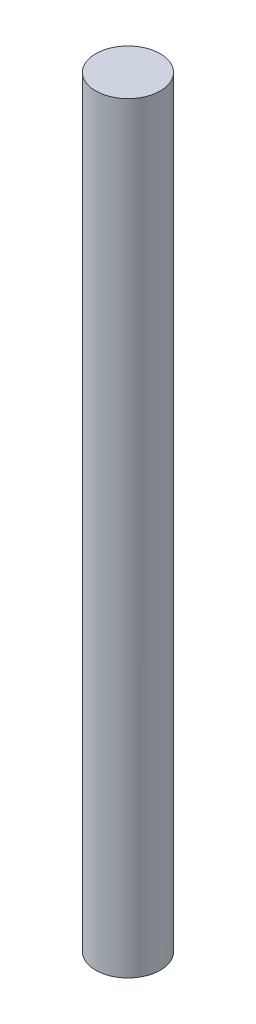
ISO-10303-21;
HEADER;
FILE_DESCRIPTION(('STEP AP214'),'2;1');
FILE_NAME('part.step','',(''),(''),'','','');
FILE_SCHEMA(('AUTOMOTIVE_DESIGN { 1 0 10303 214 1 1 1 1 }'));
ENDSEC;
DATA;
#1=APPLICATION_CONTEXT('core data for automotive mechanical design processes');
#2=APPLICATION_PROTOCOL_DEFINITION('international standard','automotive_design',2000,#1);
#3=PRODUCT_CONTEXT('',#1,'mechanical');
#4=PRODUCT('Part','Part','',(#3));
#5=PRODUCT_RELATED_PRODUCT_CATEGORY('part','',(#4));
#6=PRODUCT_DEFINITION_FORMATION('','',#4);
#7=PRODUCT_DEFINITION_CONTEXT('part definition',#1,'design');
#8=PRODUCT_DEFINITION('design','',#6,#7);
#9=PRODUCT_DEFINITION_SHAPE('','',#8);
#10=(LENGTH_UNIT() NAMED_UNIT(*) SI_UNIT(.MILLI.,.METRE.));
#11=(NAMED_UNIT(*) PLANE_ANGLE_UNIT() SI_UNIT($,.RADIAN.));
#12=(NAMED_UNIT(*) SI_UNIT($,.STERADIAN.) SOLID_ANGLE_UNIT());
#13=UNCERTAINTY_MEASURE_WITH_UNIT(LENGTH_MEASURE(1.E-05),#10,'distance_accuracy_value','');
#14=(GEOMETRIC_REPRESENTATION_CONTEXT(3) GLOBAL_UNCERTAINTY_ASSIGNED_CONTEXT((#13)) GLOBAL_UNIT_ASSIGNED_CONTEXT((#10,
#11,#12)) REPRESENTATION_CONTEXT('',''));
#15=CARTESIAN_POINT('',(0.,0.,0.));
#16=DIRECTION('',(0.,0.,1.));
#17=DIRECTION('',(1.,0.,0.));
#18=AXIS2_PLACEMENT_3D('',#15,#16,#17);
#19=CARTESIAN_POINT('',(0.,2.8699156937846,0.));
#20=DIRECTION('',(0.,-1.,0.));
#21=DIRECTION('',(0.,0.,-1.));
#22=AXIS2_PLACEMENT_3D('',#19,#20,#21);
#23=PLANE('',#22);
#24=CARTESIAN_POINT('',(0.,2.8699156937846,0.));
#25=DIRECTION('',(0.,-1.,0.));
#26=DIRECTION('',(0.,0.,-1.));
#27=AXIS2_PLACEMENT_3D('',#24,#25,#26);
#28=CIRCLE('',#27,0.75);
#29=CARTESIAN_POINT('',(0.,2.8699156937846,-0.75));
#30=VERTEX_POINT('',#29);
#31=EDGE_CURVE('E42',#30,#30,#28,.T.);
#32=ORIENTED_EDGE('',*,*,#31,.F.);
#33=EDGE_LOOP('',(#32));
#34=FACE_BOUND('',#33,.T.);
#35=ADVANCED_FACE('F35',(#34),#23,.F.);
#36=CARTESIAN_POINT('',(0.,-16.951404649775,0.));
#37=DIRECTION('',(0.,1.,0.));
#38=DIRECTION('',(0.,0.,1.));
#39=AXIS2_PLACEMENT_3D('',#36,#37,#38);
#40=CYLINDRICAL_SURFACE('',#39,0.75);
#41=CARTESIAN_POINT('',(0.,-14.8300843062154,0.));
#42=DIRECTION('',(0.,1.,0.));
#43=DIRECTION('',(0.,0.,1.));
#44=AXIS2_PLACEMENT_3D('',#41,#42,#43);
#45=CIRCLE('',#44,0.75);
#46=CARTESIAN_POINT('',(0.,-14.8300843062154,0.75));
#47=VERTEX_POINT('',#46);
#48=EDGE_CURVE('E10',#47,#47,#45,.T.);
#49=ORIENTED_EDGE('',*,*,#48,.T.);
#50=EDGE_LOOP('',(#49));
#51=FACE_BOUND('',#50,.T.);
#52=ORIENTED_EDGE('',*,*,#31,.T.);
#53=EDGE_LOOP('',(#52));
#54=FACE_BOUND('',#53,.T.);
#55=ADVANCED_FACE('F37',(#51,#54),#40,.T.);
#56=CARTESIAN_POINT('',(-0.057723440626573,-14.8300843062154,0.));
#57=DIRECTION('',(0.,1.,0.));
#58=DIRECTION('',(0.,0.,1.));
#59=AXIS2_PLACEMENT_3D('',#56,#57,#58);
#60=PLANE('',#59);
#61=ORIENTED_EDGE('',*,*,#48,.F.);
#62=EDGE_LOOP('',(#61));
#63=FACE_BOUND('',#62,.T.);
#64=ADVANCED_FACE('F53',(#63),#60,.F.);
#65=CLOSED_SHELL('',(#35,#55,#64));
#66=MANIFOLD_SOLID_BREP('B2',#65);
#67=ADVANCED_BREP_SHAPE_REPRESENTATION('',(#18,#66),#14);
#68=SHAPE_DEFINITION_REPRESENTATION(#9,#67);
ENDSEC;
END-ISO-10303-21;
